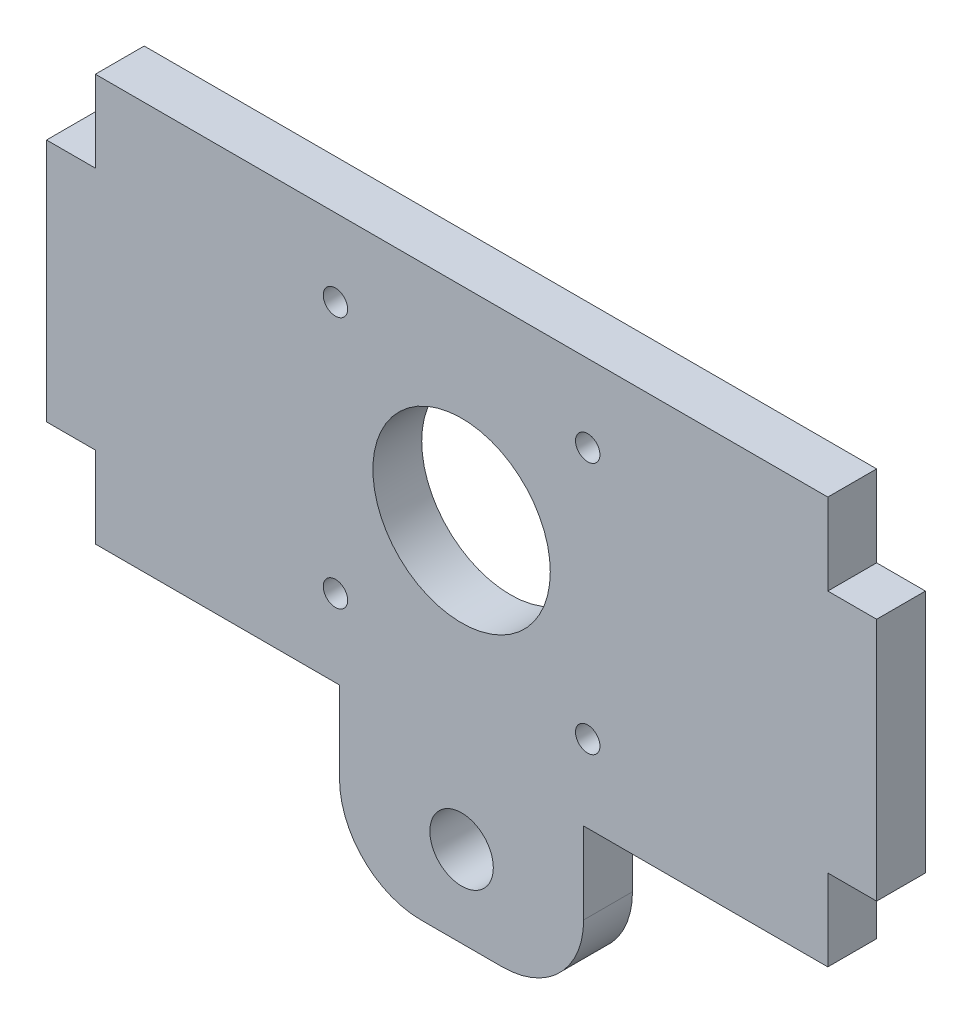
ISO-10303-21;
HEADER;
FILE_DESCRIPTION(('STEP AP214'),'2;1');
FILE_NAME('part.step','',(''),(''),'','','');
FILE_SCHEMA(('AUTOMOTIVE_DESIGN { 1 0 10303 214 1 1 1 1 }'));
ENDSEC;
DATA;
#1=APPLICATION_CONTEXT('core data for automotive mechanical design processes');
#2=APPLICATION_PROTOCOL_DEFINITION('international standard','automotive_design',2000,#1);
#3=PRODUCT_CONTEXT('',#1,'mechanical');
#4=PRODUCT('Part','Part','',(#3));
#5=PRODUCT_RELATED_PRODUCT_CATEGORY('part','',(#4));
#6=PRODUCT_DEFINITION_FORMATION('','',#4);
#7=PRODUCT_DEFINITION_CONTEXT('part definition',#1,'design');
#8=PRODUCT_DEFINITION('design','',#6,#7);
#9=PRODUCT_DEFINITION_SHAPE('','',#8);
#10=(LENGTH_UNIT() NAMED_UNIT(*) SI_UNIT(.MILLI.,.METRE.));
#11=(NAMED_UNIT(*) PLANE_ANGLE_UNIT() SI_UNIT($,.RADIAN.));
#12=(NAMED_UNIT(*) SI_UNIT($,.STERADIAN.) SOLID_ANGLE_UNIT());
#13=UNCERTAINTY_MEASURE_WITH_UNIT(LENGTH_MEASURE(1.E-05),#10,'distance_accuracy_value','');
#14=(GEOMETRIC_REPRESENTATION_CONTEXT(3) GLOBAL_UNCERTAINTY_ASSIGNED_CONTEXT((#13)) GLOBAL_UNIT_ASSIGNED_CONTEXT((#10,
#11,#12)) REPRESENTATION_CONTEXT('',''));
#15=CARTESIAN_POINT('',(0.,0.,0.));
#16=DIRECTION('',(0.,0.,1.));
#17=DIRECTION('',(1.,0.,0.));
#18=AXIS2_PLACEMENT_3D('',#15,#16,#17);
#19=CARTESIAN_POINT('',(45.,-25.,6.));
#20=DIRECTION('',(-1.,0.,0.));
#21=DIRECTION('',(0.,0.,1.));
#22=AXIS2_PLACEMENT_3D('',#19,#20,#21);
#23=PLANE('',#22);
#24=DIRECTION('',(0.,1.,0.));
#25=VECTOR('',#24,1.);
#26=CARTESIAN_POINT('',(45.,-25.,6.));
#27=LINE('',#26,#25);
#28=CARTESIAN_POINT('',(45.,15.,5.99999999999999));
#29=VERTEX_POINT('',#28);
#30=CARTESIAN_POINT('',(45.,25.,6.));
#31=VERTEX_POINT('',#30);
#32=EDGE_CURVE('E236',#29,#31,#27,.T.);
#33=ORIENTED_EDGE('',*,*,#32,.F.);
#34=DIRECTION('',(0.,0.,-1.));
#35=VECTOR('',#34,1.);
#36=CARTESIAN_POINT('',(45.,15.,5.99999999999998));
#37=LINE('',#36,#35);
#38=CARTESIAN_POINT('',(45.,15.,0.));
#39=VERTEX_POINT('',#38);
#40=EDGE_CURVE('E228',#29,#39,#37,.T.);
#41=ORIENTED_EDGE('',*,*,#40,.T.);
#42=DIRECTION('',(0.,1.,0.));
#43=VECTOR('',#42,1.);
#44=CARTESIAN_POINT('',(45.,-25.,0.));
#45=LINE('',#44,#43);
#46=CARTESIAN_POINT('',(45.,25.,0.));
#47=VERTEX_POINT('',#46);
#48=EDGE_CURVE('E231',#39,#47,#45,.T.);
#49=ORIENTED_EDGE('',*,*,#48,.T.);
#50=DIRECTION('',(0.,0.,-1.));
#51=VECTOR('',#50,1.);
#52=CARTESIAN_POINT('',(45.,25.,6.));
#53=LINE('',#52,#51);
#54=EDGE_CURVE('E285',#31,#47,#53,.T.);
#55=ORIENTED_EDGE('',*,*,#54,.F.);
#56=EDGE_LOOP('',(#33,#41,#49,#55));
#57=FACE_BOUND('',#56,.T.);
#58=ADVANCED_FACE('F35',(#57),#23,.F.);
#59=CARTESIAN_POINT('',(-45.,-25.,6.));
#60=DIRECTION('',(1.,0.,0.));
#61=DIRECTION('',(0.,0.,-1.));
#62=AXIS2_PLACEMENT_3D('',#59,#60,#61);
#63=PLANE('',#62);
#64=DIRECTION('',(0.,-1.,0.));
#65=VECTOR('',#64,1.);
#66=CARTESIAN_POINT('',(-45.,-25.,0.));
#67=LINE('',#66,#65);
#68=CARTESIAN_POINT('',(-45.,25.,0.));
#69=VERTEX_POINT('',#68);
#70=CARTESIAN_POINT('',(-45.,15.,0.));
#71=VERTEX_POINT('',#70);
#72=EDGE_CURVE('E258',#69,#71,#67,.T.);
#73=ORIENTED_EDGE('',*,*,#72,.T.);
#74=DIRECTION('',(0.,0.,1.));
#75=VECTOR('',#74,1.);
#76=CARTESIAN_POINT('',(-45.,15.,5.99999999999998));
#77=LINE('',#76,#75);
#78=CARTESIAN_POINT('',(-45.,15.,5.99999999999999));
#79=VERTEX_POINT('',#78);
#80=EDGE_CURVE('E225',#71,#79,#77,.T.);
#81=ORIENTED_EDGE('',*,*,#80,.T.);
#82=DIRECTION('',(0.,-1.,0.));
#83=VECTOR('',#82,1.);
#84=CARTESIAN_POINT('',(-45.,-25.,6.));
#85=LINE('',#84,#83);
#86=CARTESIAN_POINT('',(-45.,25.,6.));
#87=VERTEX_POINT('',#86);
#88=EDGE_CURVE('E239',#87,#79,#85,.T.);
#89=ORIENTED_EDGE('',*,*,#88,.F.);
#90=DIRECTION('',(0.,0.,-1.));
#91=VECTOR('',#90,1.);
#92=CARTESIAN_POINT('',(-45.,25.,6.));
#93=LINE('',#92,#91);
#94=EDGE_CURVE('E282',#87,#69,#93,.T.);
#95=ORIENTED_EDGE('',*,*,#94,.T.);
#96=EDGE_LOOP('',(#73,#81,#89,#95));
#97=FACE_BOUND('',#96,.T.);
#98=ADVANCED_FACE('F332',(#97),#63,.F.);
#99=CARTESIAN_POINT('',(45.,-25.,0.));
#100=VERTEX_POINT('',#99);
#101=CARTESIAN_POINT('',(45.,-15.,0.));
#102=VERTEX_POINT('',#101);
#103=EDGE_CURVE('E253',#100,#102,#45,.T.);
#104=ORIENTED_EDGE('',*,*,#103,.T.);
#105=DIRECTION('',(0.,0.,1.));
#106=VECTOR('',#105,1.);
#107=CARTESIAN_POINT('',(45.,-15.,6.));
#108=LINE('',#107,#106);
#109=CARTESIAN_POINT('',(45.,-15.,6.));
#110=VERTEX_POINT('',#109);
#111=EDGE_CURVE('E222',#102,#110,#108,.T.);
#112=ORIENTED_EDGE('',*,*,#111,.T.);
#113=CARTESIAN_POINT('',(45.,-25.,6.));
#114=VERTEX_POINT('',#113);
#115=EDGE_CURVE('E232',#114,#110,#27,.T.);
#116=ORIENTED_EDGE('',*,*,#115,.F.);
#117=DIRECTION('',(0.,0.,-1.));
#118=VECTOR('',#117,1.);
#119=CARTESIAN_POINT('',(45.,-25.,6.));
#120=LINE('',#119,#118);
#121=EDGE_CURVE('E252',#114,#100,#120,.T.);
#122=ORIENTED_EDGE('',*,*,#121,.T.);
#123=EDGE_LOOP('',(#104,#112,#116,#122));
#124=FACE_BOUND('',#123,.T.);
#125=ADVANCED_FACE('F353',(#124),#23,.F.);
#126=CARTESIAN_POINT('',(-45.,25.,6.));
#127=DIRECTION('',(0.,-1.,0.));
#128=DIRECTION('',(0.,0.,-1.));
#129=AXIS2_PLACEMENT_3D('',#126,#127,#128);
#130=PLANE('',#129);
#131=DIRECTION('',(-1.,0.,0.));
#132=VECTOR('',#131,1.);
#133=CARTESIAN_POINT('',(-45.,25.,0.));
#134=LINE('',#133,#132);
#135=EDGE_CURVE('E256',#47,#69,#134,.T.);
#136=ORIENTED_EDGE('',*,*,#135,.T.);
#137=ORIENTED_EDGE('',*,*,#94,.F.);
#138=DIRECTION('',(-1.,0.,0.));
#139=VECTOR('',#138,1.);
#140=CARTESIAN_POINT('',(-45.,25.,6.));
#141=LINE('',#140,#139);
#142=EDGE_CURVE('E235',#31,#87,#141,.T.);
#143=ORIENTED_EDGE('',*,*,#142,.F.);
#144=ORIENTED_EDGE('',*,*,#54,.T.);
#145=EDGE_LOOP('',(#136,#137,#143,#144));
#146=FACE_BOUND('',#145,.T.);
#147=ADVANCED_FACE('F337',(#146),#130,.F.);
#148=CARTESIAN_POINT('',(-45.,-15.,6.));
#149=VERTEX_POINT('',#148);
#150=CARTESIAN_POINT('',(-45.,-25.,6.));
#151=VERTEX_POINT('',#150);
#152=EDGE_CURVE('E238',#149,#151,#85,.T.);
#153=ORIENTED_EDGE('',*,*,#152,.F.);
#154=DIRECTION('',(0.,0.,-1.));
#155=VECTOR('',#154,1.);
#156=CARTESIAN_POINT('',(-45.,-15.,6.));
#157=LINE('',#156,#155);
#158=CARTESIAN_POINT('',(-45.,-15.,0.));
#159=VERTEX_POINT('',#158);
#160=EDGE_CURVE('E212',#149,#159,#157,.T.);
#161=ORIENTED_EDGE('',*,*,#160,.T.);
#162=CARTESIAN_POINT('',(-45.,-25.,0.));
#163=VERTEX_POINT('',#162);
#164=EDGE_CURVE('E170',#159,#163,#67,.T.);
#165=ORIENTED_EDGE('',*,*,#164,.T.);
#166=DIRECTION('',(0.,0.,-1.));
#167=VECTOR('',#166,1.);
#168=CARTESIAN_POINT('',(-45.,-25.,6.));
#169=LINE('',#168,#167);
#170=EDGE_CURVE('E279',#151,#163,#169,.T.);
#171=ORIENTED_EDGE('',*,*,#170,.F.);
#172=EDGE_LOOP('',(#153,#161,#165,#171));
#173=FACE_BOUND('',#172,.T.);
#174=ADVANCED_FACE('F326',(#173),#63,.F.);
#175=CARTESIAN_POINT('',(-45.,-25.,6.));
#176=DIRECTION('',(0.,1.,0.));
#177=DIRECTION('',(0.,0.,1.));
#178=AXIS2_PLACEMENT_3D('',#175,#176,#177);
#179=PLANE('',#178);
#180=DIRECTION('',(1.,0.,0.));
#181=VECTOR('',#180,1.);
#182=CARTESIAN_POINT('',(-45.,-25.,0.));
#183=LINE('',#182,#181);
#184=CARTESIAN_POINT('',(-15.,-25.,0.));
#185=VERTEX_POINT('',#184);
#186=EDGE_CURVE('E261',#163,#185,#183,.T.);
#187=ORIENTED_EDGE('',*,*,#186,.T.);
#188=DIRECTION('',(0.,0.,-1.));
#189=VECTOR('',#188,1.);
#190=CARTESIAN_POINT('',(-15.,-25.,6.));
#191=LINE('',#190,#189);
#192=CARTESIAN_POINT('',(-15.,-25.,6.));
#193=VERTEX_POINT('',#192);
#194=EDGE_CURVE('E276',#193,#185,#191,.T.);
#195=ORIENTED_EDGE('',*,*,#194,.F.);
#196=DIRECTION('',(1.,0.,0.));
#197=VECTOR('',#196,1.);
#198=CARTESIAN_POINT('',(-45.,-25.,6.));
#199=LINE('',#198,#197);
#200=EDGE_CURVE('E242',#151,#193,#199,.T.);
#201=ORIENTED_EDGE('',*,*,#200,.F.);
#202=ORIENTED_EDGE('',*,*,#170,.T.);
#203=EDGE_LOOP('',(#187,#195,#201,#202));
#204=FACE_BOUND('',#203,.T.);
#205=ADVANCED_FACE('F322',(#204),#179,.F.);
#206=CARTESIAN_POINT('',(-15.,-45.,6.));
#207=DIRECTION('',(1.,0.,0.));
#208=DIRECTION('',(0.,0.,-1.));
#209=AXIS2_PLACEMENT_3D('',#206,#207,#208);
#210=PLANE('',#209);
#211=DIRECTION('',(0.,-1.,0.));
#212=VECTOR('',#211,1.);
#213=CARTESIAN_POINT('',(-15.,-45.,0.));
#214=LINE('',#213,#212);
#215=CARTESIAN_POINT('',(-15.,-35.,0.));
#216=VERTEX_POINT('',#215);
#217=EDGE_CURVE('E263',#185,#216,#214,.T.);
#218=ORIENTED_EDGE('',*,*,#217,.T.);
#219=DIRECTION('',(0.,0.,-1.));
#220=VECTOR('',#219,1.);
#221=CARTESIAN_POINT('',(-15.,-35.,6.));
#222=LINE('',#221,#220);
#223=CARTESIAN_POINT('',(-15.,-35.,6.));
#224=VERTEX_POINT('',#223);
#225=EDGE_CURVE('E11',#216,#224,#222,.F.);
#226=ORIENTED_EDGE('',*,*,#225,.T.);
#227=DIRECTION('',(0.,-1.,0.));
#228=VECTOR('',#227,1.);
#229=CARTESIAN_POINT('',(-15.,-45.,6.));
#230=LINE('',#229,#228);
#231=EDGE_CURVE('E244',#193,#224,#230,.T.);
#232=ORIENTED_EDGE('',*,*,#231,.F.);
#233=ORIENTED_EDGE('',*,*,#194,.T.);
#234=EDGE_LOOP('',(#218,#226,#232,#233));
#235=FACE_BOUND('',#234,.T.);
#236=ADVANCED_FACE('F318',(#235),#210,.F.);
#237=CARTESIAN_POINT('',(-15.,-45.,6.));
#238=DIRECTION('',(0.,1.,0.));
#239=DIRECTION('',(0.,0.,1.));
#240=AXIS2_PLACEMENT_3D('',#237,#238,#239);
#241=PLANE('',#240);
#242=DIRECTION('',(1.,0.,0.));
#243=VECTOR('',#242,1.);
#244=CARTESIAN_POINT('',(-15.,-45.,0.));
#245=LINE('',#244,#243);
#246=CARTESIAN_POINT('',(-5.,-45.,0.));
#247=VERTEX_POINT('',#246);
#248=CARTESIAN_POINT('',(5.,-45.,0.));
#249=VERTEX_POINT('',#248);
#250=EDGE_CURVE('E265',#247,#249,#245,.T.);
#251=ORIENTED_EDGE('',*,*,#250,.T.);
#252=DIRECTION('',(0.,0.,-1.));
#253=VECTOR('',#252,1.);
#254=CARTESIAN_POINT('',(5.,-45.,6.));
#255=LINE('',#254,#253);
#256=CARTESIAN_POINT('',(5.,-45.,6.));
#257=VERTEX_POINT('',#256);
#258=EDGE_CURVE('E56',#249,#257,#255,.F.);
#259=ORIENTED_EDGE('',*,*,#258,.T.);
#260=DIRECTION('',(1.,0.,0.));
#261=VECTOR('',#260,1.);
#262=CARTESIAN_POINT('',(-15.,-45.,6.));
#263=LINE('',#262,#261);
#264=CARTESIAN_POINT('',(-5.,-45.,6.));
#265=VERTEX_POINT('',#264);
#266=EDGE_CURVE('E246',#265,#257,#263,.T.);
#267=ORIENTED_EDGE('',*,*,#266,.F.);
#268=DIRECTION('',(0.,0.,-1.));
#269=VECTOR('',#268,1.);
#270=CARTESIAN_POINT('',(-5.,-45.,6.));
#271=LINE('',#270,#269);
#272=EDGE_CURVE('E295',#265,#247,#271,.T.);
#273=ORIENTED_EDGE('',*,*,#272,.T.);
#274=EDGE_LOOP('',(#251,#259,#267,#273));
#275=FACE_BOUND('',#274,.T.);
#276=ADVANCED_FACE('F313',(#275),#241,.F.);
#277=CARTESIAN_POINT('',(15.,-45.,6.));
#278=DIRECTION('',(-1.,0.,0.));
#279=DIRECTION('',(0.,0.,1.));
#280=AXIS2_PLACEMENT_3D('',#277,#278,#279);
#281=PLANE('',#280);
#282=DIRECTION('',(0.,1.,0.));
#283=VECTOR('',#282,1.);
#284=CARTESIAN_POINT('',(15.,-45.,6.));
#285=LINE('',#284,#283);
#286=CARTESIAN_POINT('',(15.,-35.,6.));
#287=VERTEX_POINT('',#286);
#288=CARTESIAN_POINT('',(15.,-25.,6.));
#289=VERTEX_POINT('',#288);
#290=EDGE_CURVE('E248',#287,#289,#285,.T.);
#291=ORIENTED_EDGE('',*,*,#290,.F.);
#292=DIRECTION('',(0.,0.,-1.));
#293=VECTOR('',#292,1.);
#294=CARTESIAN_POINT('',(15.,-35.,6.));
#295=LINE('',#294,#293);
#296=CARTESIAN_POINT('',(15.,-35.,0.));
#297=VERTEX_POINT('',#296);
#298=EDGE_CURVE('E288',#287,#297,#295,.T.);
#299=ORIENTED_EDGE('',*,*,#298,.T.);
#300=DIRECTION('',(0.,1.,0.));
#301=VECTOR('',#300,1.);
#302=CARTESIAN_POINT('',(15.,-45.,0.));
#303=LINE('',#302,#301);
#304=CARTESIAN_POINT('',(15.,-25.,0.));
#305=VERTEX_POINT('',#304);
#306=EDGE_CURVE('E267',#297,#305,#303,.T.);
#307=ORIENTED_EDGE('',*,*,#306,.T.);
#308=DIRECTION('',(0.,0.,-1.));
#309=VECTOR('',#308,1.);
#310=CARTESIAN_POINT('',(15.,-25.,6.));
#311=LINE('',#310,#309);
#312=EDGE_CURVE('E273',#289,#305,#311,.T.);
#313=ORIENTED_EDGE('',*,*,#312,.F.);
#314=EDGE_LOOP('',(#291,#299,#307,#313));
#315=FACE_BOUND('',#314,.T.);
#316=ADVANCED_FACE('F308',(#315),#281,.F.);
#317=CARTESIAN_POINT('',(15.,-25.,6.));
#318=DIRECTION('',(0.,1.,0.));
#319=DIRECTION('',(0.,0.,1.));
#320=AXIS2_PLACEMENT_3D('',#317,#318,#319);
#321=PLANE('',#320);
#322=DIRECTION('',(1.,0.,0.));
#323=VECTOR('',#322,1.);
#324=CARTESIAN_POINT('',(15.,-25.,0.));
#325=LINE('',#324,#323);
#326=EDGE_CURVE('E269',#305,#100,#325,.T.);
#327=ORIENTED_EDGE('',*,*,#326,.T.);
#328=ORIENTED_EDGE('',*,*,#121,.F.);
#329=DIRECTION('',(1.,0.,0.));
#330=VECTOR('',#329,1.);
#331=CARTESIAN_POINT('',(15.,-25.,6.));
#332=LINE('',#331,#330);
#333=EDGE_CURVE('E250',#289,#114,#332,.T.);
#334=ORIENTED_EDGE('',*,*,#333,.F.);
#335=ORIENTED_EDGE('',*,*,#312,.T.);
#336=EDGE_LOOP('',(#327,#328,#334,#335));
#337=FACE_BOUND('',#336,.T.);
#338=ADVANCED_FACE('F357',(#337),#321,.F.);
#339=CARTESIAN_POINT('',(0.,0.,6.));
#340=DIRECTION('',(0.,0.,-1.));
#341=DIRECTION('',(-1.,0.,0.));
#342=AXIS2_PLACEMENT_3D('',#339,#340,#341);
#343=PLANE('',#342);
#344=CARTESIAN_POINT('',(15.5,15.5,6.));
#345=DIRECTION('',(0.,0.,1.));
#346=DIRECTION('',(1.,0.,0.));
#347=AXIS2_PLACEMENT_3D('',#344,#345,#346);
#348=CIRCLE('',#347,1.5);
#349=CARTESIAN_POINT('',(17.,15.5,6.));
#350=VERTEX_POINT('',#349);
#351=EDGE_CURVE('E587',#350,#350,#348,.T.);
#352=ORIENTED_EDGE('',*,*,#351,.F.);
#353=EDGE_LOOP('',(#352));
#354=FACE_BOUND('',#353,.T.);
#355=CARTESIAN_POINT('',(15.5,-15.5,6.));
#356=DIRECTION('',(0.,0.,1.));
#357=DIRECTION('',(1.,0.,0.));
#358=AXIS2_PLACEMENT_3D('',#355,#356,#357);
#359=CIRCLE('',#358,1.5);
#360=CARTESIAN_POINT('',(17.,-15.5,6.));
#361=VERTEX_POINT('',#360);
#362=EDGE_CURVE('E594',#361,#361,#359,.T.);
#363=ORIENTED_EDGE('',*,*,#362,.F.);
#364=EDGE_LOOP('',(#363));
#365=FACE_BOUND('',#364,.T.);
#366=CARTESIAN_POINT('',(-15.5,-15.5,6.));
#367=DIRECTION('',(0.,0.,1.));
#368=DIRECTION('',(1.,0.,0.));
#369=AXIS2_PLACEMENT_3D('',#366,#367,#368);
#370=CIRCLE('',#369,1.5);
#371=CARTESIAN_POINT('',(-14.,-15.5,6.));
#372=VERTEX_POINT('',#371);
#373=EDGE_CURVE('E602',#372,#372,#370,.T.);
#374=ORIENTED_EDGE('',*,*,#373,.F.);
#375=EDGE_LOOP('',(#374));
#376=FACE_BOUND('',#375,.T.);
#377=CARTESIAN_POINT('',(0.,0.,6.));
#378=DIRECTION('',(0.,0.,1.));
#379=DIRECTION('',(1.,0.,0.));
#380=AXIS2_PLACEMENT_3D('',#377,#378,#379);
#381=CIRCLE('',#380,10.9);
#382=CARTESIAN_POINT('',(10.9,0.,6.));
#383=VERTEX_POINT('',#382);
#384=EDGE_CURVE('E608',#383,#383,#381,.T.);
#385=ORIENTED_EDGE('',*,*,#384,.F.);
#386=EDGE_LOOP('',(#385));
#387=FACE_BOUND('',#386,.T.);
#388=CARTESIAN_POINT('',(0.,-35.,6.));
#389=DIRECTION('',(0.,0.,1.));
#390=DIRECTION('',(1.,0.,0.));
#391=AXIS2_PLACEMENT_3D('',#388,#389,#390);
#392=CIRCLE('',#391,3.9);
#393=CARTESIAN_POINT('',(3.9,-35.,6.));
#394=VERTEX_POINT('',#393);
#395=EDGE_CURVE('E614',#394,#394,#392,.T.);
#396=ORIENTED_EDGE('',*,*,#395,.F.);
#397=EDGE_LOOP('',(#396));
#398=FACE_BOUND('',#397,.T.);
#399=CARTESIAN_POINT('',(-15.5,15.5,6.));
#400=DIRECTION('',(0.,0.,1.));
#401=DIRECTION('',(1.,0.,0.));
#402=AXIS2_PLACEMENT_3D('',#399,#400,#401);
#403=CIRCLE('',#402,1.5);
#404=CARTESIAN_POINT('',(-14.,15.5,6.));
#405=VERTEX_POINT('',#404);
#406=EDGE_CURVE('E190',#405,#405,#403,.T.);
#407=ORIENTED_EDGE('',*,*,#406,.F.);
#408=EDGE_LOOP('',(#407));
#409=FACE_BOUND('',#408,.T.);
#410=ORIENTED_EDGE('',*,*,#266,.T.);
#411=CARTESIAN_POINT('',(5.,-35.,6.));
#412=DIRECTION('',(0.,0.,-1.));
#413=DIRECTION('',(-1.,0.,0.));
#414=AXIS2_PLACEMENT_3D('',#411,#412,#413);
#415=CIRCLE('',#414,10.);
#416=EDGE_CURVE('E43',#257,#287,#415,.F.);
#417=ORIENTED_EDGE('',*,*,#416,.T.);
#418=ORIENTED_EDGE('',*,*,#290,.T.);
#419=ORIENTED_EDGE('',*,*,#333,.T.);
#420=ORIENTED_EDGE('',*,*,#115,.T.);
#421=DIRECTION('',(-1.,0.,0.));
#422=VECTOR('',#421,1.);
#423=CARTESIAN_POINT('',(51.,-15.,6.));
#424=LINE('',#423,#422);
#425=CARTESIAN_POINT('',(51.,-15.,6.));
#426=VERTEX_POINT('',#425);
#427=EDGE_CURVE('E218',#426,#110,#424,.T.);
#428=ORIENTED_EDGE('',*,*,#427,.F.);
#429=DIRECTION('',(0.,1.,0.));
#430=VECTOR('',#429,1.);
#431=CARTESIAN_POINT('',(51.,15.,5.99999999999999));
#432=LINE('',#431,#430);
#433=CARTESIAN_POINT('',(51.,15.,5.99999999999999));
#434=VERTEX_POINT('',#433);
#435=EDGE_CURVE('E205',#426,#434,#432,.T.);
#436=ORIENTED_EDGE('',*,*,#435,.T.);
#437=DIRECTION('',(-1.,0.,0.));
#438=VECTOR('',#437,1.);
#439=CARTESIAN_POINT('',(51.,15.,5.99999999999999));
#440=LINE('',#439,#438);
#441=EDGE_CURVE('E214',#434,#29,#440,.T.);
#442=ORIENTED_EDGE('',*,*,#441,.T.);
#443=ORIENTED_EDGE('',*,*,#32,.T.);
#444=ORIENTED_EDGE('',*,*,#142,.T.);
#445=ORIENTED_EDGE('',*,*,#88,.T.);
#446=CARTESIAN_POINT('',(-51.,15.,5.99999999999999));
#447=VERTEX_POINT('',#446);
#448=EDGE_CURVE('E217',#79,#447,#440,.T.);
#449=ORIENTED_EDGE('',*,*,#448,.T.);
#450=DIRECTION('',(0.,1.,0.));
#451=VECTOR('',#450,1.);
#452=CARTESIAN_POINT('',(-51.,15.,5.99999999999999));
#453=LINE('',#452,#451);
#454=CARTESIAN_POINT('',(-51.,-15.,6.));
#455=VERTEX_POINT('',#454);
#456=EDGE_CURVE('E184',#455,#447,#453,.T.);
#457=ORIENTED_EDGE('',*,*,#456,.F.);
#458=EDGE_CURVE('E180',#149,#455,#424,.T.);
#459=ORIENTED_EDGE('',*,*,#458,.F.);
#460=ORIENTED_EDGE('',*,*,#152,.T.);
#461=ORIENTED_EDGE('',*,*,#200,.T.);
#462=ORIENTED_EDGE('',*,*,#231,.T.);
#463=CARTESIAN_POINT('',(-5.,-35.,6.));
#464=DIRECTION('',(0.,0.,-1.));
#465=DIRECTION('',(-1.,0.,0.));
#466=AXIS2_PLACEMENT_3D('',#463,#464,#465);
#467=CIRCLE('',#466,10.);
#468=EDGE_CURVE('E299',#224,#265,#467,.F.);
#469=ORIENTED_EDGE('',*,*,#468,.T.);
#470=EDGE_LOOP('',(#410,#417,#418,#419,#420,#428,#436,#442,#443,#444,#445,#449,#457,#459,#460,
#461,#462,#469));
#471=FACE_BOUND('',#470,.T.);
#472=ADVANCED_FACE('F303',(#354,#365,#376,#387,#398,#409,#471),#343,.F.);
#473=CARTESIAN_POINT('',(0.,0.,0.));
#474=DIRECTION('',(0.,0.,-1.));
#475=DIRECTION('',(-1.,0.,0.));
#476=AXIS2_PLACEMENT_3D('',#473,#474,#475);
#477=PLANE('',#476);
#478=CARTESIAN_POINT('',(15.5,15.5,0.));
#479=DIRECTION('',(0.,0.,-1.));
#480=DIRECTION('',(-1.,0.,0.));
#481=AXIS2_PLACEMENT_3D('',#478,#479,#480);
#482=CIRCLE('',#481,1.5);
#483=CARTESIAN_POINT('',(14.,15.5,0.));
#484=VERTEX_POINT('',#483);
#485=EDGE_CURVE('E589',#484,#484,#482,.F.);
#486=ORIENTED_EDGE('',*,*,#485,.T.);
#487=EDGE_LOOP('',(#486));
#488=FACE_BOUND('',#487,.T.);
#489=CARTESIAN_POINT('',(15.5,-15.5,0.));
#490=DIRECTION('',(0.,0.,-1.));
#491=DIRECTION('',(-1.,0.,0.));
#492=AXIS2_PLACEMENT_3D('',#489,#490,#491);
#493=CIRCLE('',#492,1.5);
#494=CARTESIAN_POINT('',(14.,-15.5,0.));
#495=VERTEX_POINT('',#494);
#496=EDGE_CURVE('E599',#495,#495,#493,.F.);
#497=ORIENTED_EDGE('',*,*,#496,.T.);
#498=EDGE_LOOP('',(#497));
#499=FACE_BOUND('',#498,.T.);
#500=CARTESIAN_POINT('',(-15.5,-15.5,0.));
#501=DIRECTION('',(0.,0.,-1.));
#502=DIRECTION('',(-1.,0.,0.));
#503=AXIS2_PLACEMENT_3D('',#500,#501,#502);
#504=CIRCLE('',#503,1.5);
#505=CARTESIAN_POINT('',(-17.,-15.5,0.));
#506=VERTEX_POINT('',#505);
#507=EDGE_CURVE('E605',#506,#506,#504,.F.);
#508=ORIENTED_EDGE('',*,*,#507,.T.);
#509=EDGE_LOOP('',(#508));
#510=FACE_BOUND('',#509,.T.);
#511=CARTESIAN_POINT('',(0.,0.,0.));
#512=DIRECTION('',(0.,0.,-1.));
#513=DIRECTION('',(-1.,0.,0.));
#514=AXIS2_PLACEMENT_3D('',#511,#512,#513);
#515=CIRCLE('',#514,10.9);
#516=CARTESIAN_POINT('',(-10.9,0.,0.));
#517=VERTEX_POINT('',#516);
#518=EDGE_CURVE('E611',#517,#517,#515,.F.);
#519=ORIENTED_EDGE('',*,*,#518,.T.);
#520=EDGE_LOOP('',(#519));
#521=FACE_BOUND('',#520,.T.);
#522=CARTESIAN_POINT('',(0.,-35.,0.));
#523=DIRECTION('',(0.,0.,-1.));
#524=DIRECTION('',(-1.,0.,0.));
#525=AXIS2_PLACEMENT_3D('',#522,#523,#524);
#526=CIRCLE('',#525,3.9);
#527=CARTESIAN_POINT('',(-3.9,-35.,0.));
#528=VERTEX_POINT('',#527);
#529=EDGE_CURVE('E617',#528,#528,#526,.F.);
#530=ORIENTED_EDGE('',*,*,#529,.T.);
#531=EDGE_LOOP('',(#530));
#532=FACE_BOUND('',#531,.T.);
#533=CARTESIAN_POINT('',(-15.5,15.5,0.));
#534=DIRECTION('',(0.,0.,-1.));
#535=DIRECTION('',(-1.,0.,0.));
#536=AXIS2_PLACEMENT_3D('',#533,#534,#535);
#537=CIRCLE('',#536,1.5);
#538=CARTESIAN_POINT('',(-17.,15.5,0.));
#539=VERTEX_POINT('',#538);
#540=EDGE_CURVE('E193',#539,#539,#537,.F.);
#541=ORIENTED_EDGE('',*,*,#540,.T.);
#542=EDGE_LOOP('',(#541));
#543=FACE_BOUND('',#542,.T.);
#544=ORIENTED_EDGE('',*,*,#306,.F.);
#545=CARTESIAN_POINT('',(5.,-35.,0.));
#546=DIRECTION('',(0.,0.,-1.));
#547=DIRECTION('',(-1.,0.,0.));
#548=AXIS2_PLACEMENT_3D('',#545,#546,#547);
#549=CIRCLE('',#548,10.);
#550=EDGE_CURVE('E293',#297,#249,#549,.T.);
#551=ORIENTED_EDGE('',*,*,#550,.T.);
#552=ORIENTED_EDGE('',*,*,#250,.F.);
#553=CARTESIAN_POINT('',(-5.,-35.,0.));
#554=DIRECTION('',(0.,0.,-1.));
#555=DIRECTION('',(-1.,0.,0.));
#556=AXIS2_PLACEMENT_3D('',#553,#554,#555);
#557=CIRCLE('',#556,10.);
#558=EDGE_CURVE('E291',#247,#216,#557,.T.);
#559=ORIENTED_EDGE('',*,*,#558,.T.);
#560=ORIENTED_EDGE('',*,*,#217,.F.);
#561=ORIENTED_EDGE('',*,*,#186,.F.);
#562=ORIENTED_EDGE('',*,*,#164,.F.);
#563=DIRECTION('',(-1.,0.,0.));
#564=VECTOR('',#563,1.);
#565=CARTESIAN_POINT('',(51.,-15.,0.));
#566=LINE('',#565,#564);
#567=CARTESIAN_POINT('',(-51.,-15.,0.));
#568=VERTEX_POINT('',#567);
#569=EDGE_CURVE('E162',#159,#568,#566,.T.);
#570=ORIENTED_EDGE('',*,*,#569,.T.);
#571=DIRECTION('',(0.,-1.,0.));
#572=VECTOR('',#571,1.);
#573=CARTESIAN_POINT('',(-51.,15.,0.));
#574=LINE('',#573,#572);
#575=CARTESIAN_POINT('',(-51.,15.,0.));
#576=VERTEX_POINT('',#575);
#577=EDGE_CURVE('E168',#576,#568,#574,.T.);
#578=ORIENTED_EDGE('',*,*,#577,.F.);
#579=DIRECTION('',(-1.,0.,0.));
#580=VECTOR('',#579,1.);
#581=CARTESIAN_POINT('',(51.,15.,0.));
#582=LINE('',#581,#580);
#583=EDGE_CURVE('E213',#71,#576,#582,.T.);
#584=ORIENTED_EDGE('',*,*,#583,.F.);
#585=ORIENTED_EDGE('',*,*,#72,.F.);
#586=ORIENTED_EDGE('',*,*,#135,.F.);
#587=ORIENTED_EDGE('',*,*,#48,.F.);
#588=CARTESIAN_POINT('',(51.,15.,0.));
#589=VERTEX_POINT('',#588);
#590=EDGE_CURVE('E210',#589,#39,#582,.T.);
#591=ORIENTED_EDGE('',*,*,#590,.F.);
#592=DIRECTION('',(0.,-1.,0.));
#593=VECTOR('',#592,1.);
#594=CARTESIAN_POINT('',(51.,15.,0.));
#595=LINE('',#594,#593);
#596=CARTESIAN_POINT('',(51.,-15.,0.));
#597=VERTEX_POINT('',#596);
#598=EDGE_CURVE('E199',#589,#597,#595,.T.);
#599=ORIENTED_EDGE('',*,*,#598,.T.);
#600=EDGE_CURVE('E173',#597,#102,#566,.T.);
#601=ORIENTED_EDGE('',*,*,#600,.T.);
#602=ORIENTED_EDGE('',*,*,#103,.F.);
#603=ORIENTED_EDGE('',*,*,#326,.F.);
#604=EDGE_LOOP('',(#544,#551,#552,#559,#560,#561,#562,#570,#578,#584,#585,#586,#587,#591,#599,
#601,#602,#603));
#605=FACE_BOUND('',#604,.T.);
#606=ADVANCED_FACE('F165',(#488,#499,#510,#521,#532,#543,#605),#477,.T.);
#607=CARTESIAN_POINT('',(-51.,0.,0.));
#608=DIRECTION('',(-1.,0.,0.));
#609=DIRECTION('',(0.,0.,1.));
#610=AXIS2_PLACEMENT_3D('',#607,#608,#609);
#611=PLANE('',#610);
#612=ORIENTED_EDGE('',*,*,#577,.T.);
#613=DIRECTION('',(0.,0.,1.));
#614=VECTOR('',#613,1.);
#615=CARTESIAN_POINT('',(-51.,-15.,0.));
#616=LINE('',#615,#614);
#617=EDGE_CURVE('E177',#568,#455,#616,.T.);
#618=ORIENTED_EDGE('',*,*,#617,.T.);
#619=ORIENTED_EDGE('',*,*,#456,.T.);
#620=DIRECTION('',(0.,0.,-1.));
#621=VECTOR('',#620,1.);
#622=CARTESIAN_POINT('',(-51.,15.,0.));
#623=LINE('',#622,#621);
#624=EDGE_CURVE('E189',#447,#576,#623,.T.);
#625=ORIENTED_EDGE('',*,*,#624,.T.);
#626=EDGE_LOOP('',(#612,#618,#619,#625));
#627=FACE_BOUND('',#626,.T.);
#628=ADVANCED_FACE('F187',(#627),#611,.T.);
#629=CARTESIAN_POINT('',(51.,-15.,0.));
#630=DIRECTION('',(0.,-1.,0.));
#631=DIRECTION('',(0.,0.,-1.));
#632=AXIS2_PLACEMENT_3D('',#629,#630,#631);
#633=PLANE('',#632);
#634=ORIENTED_EDGE('',*,*,#160,.F.);
#635=ORIENTED_EDGE('',*,*,#458,.T.);
#636=ORIENTED_EDGE('',*,*,#617,.F.);
#637=ORIENTED_EDGE('',*,*,#569,.F.);
#638=EDGE_LOOP('',(#634,#635,#636,#637));
#639=FACE_BOUND('',#638,.T.);
#640=ADVANCED_FACE('F178',(#639),#633,.T.);
#641=CARTESIAN_POINT('',(51.,15.,0.));
#642=DIRECTION('',(0.,1.,0.));
#643=DIRECTION('',(0.,0.,1.));
#644=AXIS2_PLACEMENT_3D('',#641,#642,#643);
#645=PLANE('',#644);
#646=ORIENTED_EDGE('',*,*,#80,.F.);
#647=ORIENTED_EDGE('',*,*,#583,.T.);
#648=ORIENTED_EDGE('',*,*,#624,.F.);
#649=ORIENTED_EDGE('',*,*,#448,.F.);
#650=EDGE_LOOP('',(#646,#647,#648,#649));
#651=FACE_BOUND('',#650,.T.);
#652=ADVANCED_FACE('F328',(#651),#645,.T.);
#653=ORIENTED_EDGE('',*,*,#40,.F.);
#654=ORIENTED_EDGE('',*,*,#441,.F.);
#655=DIRECTION('',(0.,0.,-1.));
#656=VECTOR('',#655,1.);
#657=CARTESIAN_POINT('',(51.,15.,0.));
#658=LINE('',#657,#656);
#659=EDGE_CURVE('E174',#434,#589,#658,.T.);
#660=ORIENTED_EDGE('',*,*,#659,.T.);
#661=ORIENTED_EDGE('',*,*,#590,.T.);
#662=EDGE_LOOP('',(#653,#654,#660,#661));
#663=FACE_BOUND('',#662,.T.);
#664=ADVANCED_FACE('F344',(#663),#645,.T.);
#665=ORIENTED_EDGE('',*,*,#111,.F.);
#666=ORIENTED_EDGE('',*,*,#600,.F.);
#667=DIRECTION('',(0.,0.,1.));
#668=VECTOR('',#667,1.);
#669=CARTESIAN_POINT('',(51.,-15.,0.));
#670=LINE('',#669,#668);
#671=EDGE_CURVE('E202',#597,#426,#670,.T.);
#672=ORIENTED_EDGE('',*,*,#671,.T.);
#673=ORIENTED_EDGE('',*,*,#427,.T.);
#674=EDGE_LOOP('',(#665,#666,#672,#673));
#675=FACE_BOUND('',#674,.T.);
#676=ADVANCED_FACE('F486',(#675),#633,.T.);
#677=CARTESIAN_POINT('',(51.,0.,0.));
#678=DIRECTION('',(-1.,0.,0.));
#679=DIRECTION('',(0.,0.,1.));
#680=AXIS2_PLACEMENT_3D('',#677,#678,#679);
#681=PLANE('',#680);
#682=ORIENTED_EDGE('',*,*,#598,.F.);
#683=ORIENTED_EDGE('',*,*,#659,.F.);
#684=ORIENTED_EDGE('',*,*,#435,.F.);
#685=ORIENTED_EDGE('',*,*,#671,.F.);
#686=EDGE_LOOP('',(#682,#683,#684,#685));
#687=FACE_BOUND('',#686,.T.);
#688=ADVANCED_FACE('F349',(#687),#681,.F.);
#689=CARTESIAN_POINT('',(-15.5,15.5,-0.00100000000000187));
#690=DIRECTION('',(0.,0.,1.));
#691=DIRECTION('',(1.,0.,0.));
#692=AXIS2_PLACEMENT_3D('',#689,#690,#691);
#693=CYLINDRICAL_SURFACE('',#692,1.5);
#694=ORIENTED_EDGE('',*,*,#540,.F.);
#695=EDGE_LOOP('',(#694));
#696=FACE_BOUND('',#695,.T.);
#697=ORIENTED_EDGE('',*,*,#406,.T.);
#698=EDGE_LOOP('',(#697));
#699=FACE_BOUND('',#698,.T.);
#700=ADVANCED_FACE('F471',(#696,#699),#693,.F.);
#701=CARTESIAN_POINT('',(0.,-35.,-0.00100000000000187));
#702=DIRECTION('',(0.,0.,1.));
#703=DIRECTION('',(1.,0.,0.));
#704=AXIS2_PLACEMENT_3D('',#701,#702,#703);
#705=CYLINDRICAL_SURFACE('',#704,3.9);
#706=ORIENTED_EDGE('',*,*,#529,.F.);
#707=EDGE_LOOP('',(#706));
#708=FACE_BOUND('',#707,.T.);
#709=ORIENTED_EDGE('',*,*,#395,.T.);
#710=EDGE_LOOP('',(#709));
#711=FACE_BOUND('',#710,.T.);
#712=ADVANCED_FACE('F463',(#708,#711),#705,.F.);
#713=CARTESIAN_POINT('',(0.,0.,-0.00100000000000187));
#714=DIRECTION('',(0.,0.,1.));
#715=DIRECTION('',(1.,0.,0.));
#716=AXIS2_PLACEMENT_3D('',#713,#714,#715);
#717=CYLINDRICAL_SURFACE('',#716,10.9);
#718=ORIENTED_EDGE('',*,*,#518,.F.);
#719=EDGE_LOOP('',(#718));
#720=FACE_BOUND('',#719,.T.);
#721=ORIENTED_EDGE('',*,*,#384,.T.);
#722=EDGE_LOOP('',(#721));
#723=FACE_BOUND('',#722,.T.);
#724=ADVANCED_FACE('F455',(#720,#723),#717,.F.);
#725=CARTESIAN_POINT('',(-15.5,-15.5,-0.00100000000000187));
#726=DIRECTION('',(0.,0.,1.));
#727=DIRECTION('',(1.,0.,0.));
#728=AXIS2_PLACEMENT_3D('',#725,#726,#727);
#729=CYLINDRICAL_SURFACE('',#728,1.5);
#730=ORIENTED_EDGE('',*,*,#507,.F.);
#731=EDGE_LOOP('',(#730));
#732=FACE_BOUND('',#731,.T.);
#733=ORIENTED_EDGE('',*,*,#373,.T.);
#734=EDGE_LOOP('',(#733));
#735=FACE_BOUND('',#734,.T.);
#736=ADVANCED_FACE('F447',(#732,#735),#729,.F.);
#737=CARTESIAN_POINT('',(15.5,-15.5,-0.00100000000000187));
#738=DIRECTION('',(0.,0.,1.));
#739=DIRECTION('',(1.,0.,0.));
#740=AXIS2_PLACEMENT_3D('',#737,#738,#739);
#741=CYLINDRICAL_SURFACE('',#740,1.5);
#742=ORIENTED_EDGE('',*,*,#496,.F.);
#743=EDGE_LOOP('',(#742));
#744=FACE_BOUND('',#743,.T.);
#745=ORIENTED_EDGE('',*,*,#362,.T.);
#746=EDGE_LOOP('',(#745));
#747=FACE_BOUND('',#746,.T.);
#748=ADVANCED_FACE('F440',(#744,#747),#741,.F.);
#749=CARTESIAN_POINT('',(15.5,15.5,-0.00100000000000187));
#750=DIRECTION('',(0.,0.,1.));
#751=DIRECTION('',(1.,0.,0.));
#752=AXIS2_PLACEMENT_3D('',#749,#750,#751);
#753=CYLINDRICAL_SURFACE('',#752,1.5);
#754=ORIENTED_EDGE('',*,*,#485,.F.);
#755=EDGE_LOOP('',(#754));
#756=FACE_BOUND('',#755,.T.);
#757=ORIENTED_EDGE('',*,*,#351,.T.);
#758=EDGE_LOOP('',(#757));
#759=FACE_BOUND('',#758,.T.);
#760=ADVANCED_FACE('F425',(#756,#759),#753,.F.);
#761=CARTESIAN_POINT('',(5.,-35.,6.));
#762=DIRECTION('',(0.,0.,-1.));
#763=DIRECTION('',(-1.,0.,0.));
#764=AXIS2_PLACEMENT_3D('',#761,#762,#763);
#765=CYLINDRICAL_SURFACE('',#764,10.);
#766=ORIENTED_EDGE('',*,*,#416,.F.);
#767=ORIENTED_EDGE('',*,*,#258,.F.);
#768=ORIENTED_EDGE('',*,*,#550,.F.);
#769=ORIENTED_EDGE('',*,*,#298,.F.);
#770=EDGE_LOOP('',(#766,#767,#768,#769));
#771=FACE_BOUND('',#770,.T.);
#772=ADVANCED_FACE('F310',(#771),#765,.T.);
#773=CARTESIAN_POINT('',(-5.,-35.,6.));
#774=DIRECTION('',(0.,0.,-1.));
#775=DIRECTION('',(-1.,0.,0.));
#776=AXIS2_PLACEMENT_3D('',#773,#774,#775);
#777=CYLINDRICAL_SURFACE('',#776,10.);
#778=ORIENTED_EDGE('',*,*,#468,.F.);
#779=ORIENTED_EDGE('',*,*,#225,.F.);
#780=ORIENTED_EDGE('',*,*,#558,.F.);
#781=ORIENTED_EDGE('',*,*,#272,.F.);
#782=EDGE_LOOP('',(#778,#779,#780,#781));
#783=FACE_BOUND('',#782,.T.);
#784=ADVANCED_FACE('F37',(#783),#777,.T.);
#785=CLOSED_SHELL('',(#58,#98,#125,#147,#174,#205,#236,#276,#316,#338,#472,#606,#628,#640,#652,
#664,#676,#688,#700,#712,#724,#736,#748,#760,#772,#784));
#786=MANIFOLD_SOLID_BREP('B2',#785);
#787=ADVANCED_BREP_SHAPE_REPRESENTATION('',(#18,#786),#14);
#788=SHAPE_DEFINITION_REPRESENTATION(#9,#787);
ENDSEC;
END-ISO-10303-21;
